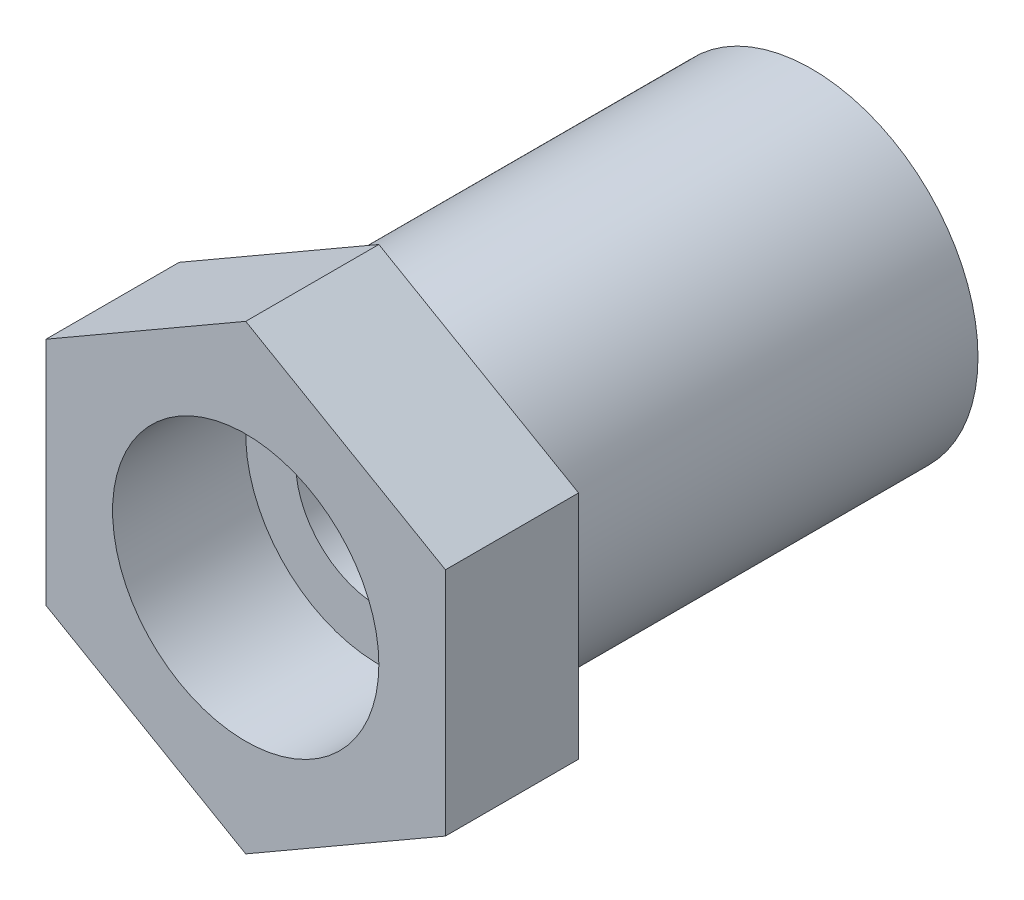
ISO-10303-21;
HEADER;
FILE_DESCRIPTION(('STEP AP214'),'2;1');
FILE_NAME('part.step','',(''),(''),'','','');
FILE_SCHEMA(('AUTOMOTIVE_DESIGN { 1 0 10303 214 1 1 1 1 }'));
ENDSEC;
DATA;
#1=APPLICATION_CONTEXT('core data for automotive mechanical design processes');
#2=APPLICATION_PROTOCOL_DEFINITION('international standard','automotive_design',2000,#1);
#3=PRODUCT_CONTEXT('',#1,'mechanical');
#4=PRODUCT('Part','Part','',(#3));
#5=PRODUCT_RELATED_PRODUCT_CATEGORY('part','',(#4));
#6=PRODUCT_DEFINITION_FORMATION('','',#4);
#7=PRODUCT_DEFINITION_CONTEXT('part definition',#1,'design');
#8=PRODUCT_DEFINITION('design','',#6,#7);
#9=PRODUCT_DEFINITION_SHAPE('','',#8);
#10=(LENGTH_UNIT() NAMED_UNIT(*) SI_UNIT(.MILLI.,.METRE.));
#11=(NAMED_UNIT(*) PLANE_ANGLE_UNIT() SI_UNIT($,.RADIAN.));
#12=(NAMED_UNIT(*) SI_UNIT($,.STERADIAN.) SOLID_ANGLE_UNIT());
#13=UNCERTAINTY_MEASURE_WITH_UNIT(LENGTH_MEASURE(1.E-05),#10,'distance_accuracy_value','');
#14=(GEOMETRIC_REPRESENTATION_CONTEXT(3) GLOBAL_UNCERTAINTY_ASSIGNED_CONTEXT((#13)) GLOBAL_UNIT_ASSIGNED_CONTEXT((#10,
#11,#12)) REPRESENTATION_CONTEXT('',''));
#15=CARTESIAN_POINT('',(0.,0.,0.));
#16=DIRECTION('',(0.,0.,1.));
#17=DIRECTION('',(1.,0.,0.));
#18=AXIS2_PLACEMENT_3D('',#15,#16,#17);
#19=CARTESIAN_POINT('',(-29.0609497882638,5.3372408293461,13.));
#20=DIRECTION('',(0.,0.,-1.));
#21=DIRECTION('',(-1.,0.,0.));
#22=AXIS2_PLACEMENT_3D('',#19,#20,#21);
#23=CYLINDRICAL_SURFACE('',#22,5.);
#24=CARTESIAN_POINT('',(-29.0609497882638,5.3372408293461,13.));
#25=DIRECTION('',(0.,0.,1.));
#26=DIRECTION('',(1.,0.,0.));
#27=AXIS2_PLACEMENT_3D('',#24,#25,#26);
#28=CIRCLE('',#27,5.);
#29=CARTESIAN_POINT('',(-24.0609497882638,5.3372408293461,13.));
#30=VERTEX_POINT('',#29);
#31=EDGE_CURVE('E11',#30,#30,#28,.T.);
#32=ORIENTED_EDGE('',*,*,#31,.F.);
#33=EDGE_LOOP('',(#32));
#34=FACE_BOUND('',#33,.T.);
#35=CARTESIAN_POINT('',(-29.0609497882638,5.3372408293461,0.));
#36=DIRECTION('',(0.,0.,1.));
#37=DIRECTION('',(1.,0.,0.));
#38=AXIS2_PLACEMENT_3D('',#35,#36,#37);
#39=CIRCLE('',#38,5.);
#40=CARTESIAN_POINT('',(-24.0609497882638,5.3372408293461,0.));
#41=VERTEX_POINT('',#40);
#42=EDGE_CURVE('E36',#41,#41,#39,.T.);
#43=ORIENTED_EDGE('',*,*,#42,.T.);
#44=EDGE_LOOP('',(#43));
#45=FACE_BOUND('',#44,.T.);
#46=ADVANCED_FACE('F33',(#34,#45),#23,.T.);
#47=CARTESIAN_POINT('',(-29.0609497882638,5.3372408293461,0.));
#48=DIRECTION('',(0.,0.,1.));
#49=DIRECTION('',(1.,0.,0.));
#50=AXIS2_PLACEMENT_3D('',#47,#48,#49);
#51=PLANE('',#50);
#52=CARTESIAN_POINT('',(-29.0609497882638,5.3372408293461,0.));
#53=DIRECTION('',(0.,0.,-1.));
#54=DIRECTION('',(-1.,0.,0.));
#55=AXIS2_PLACEMENT_3D('',#52,#53,#54);
#56=CIRCLE('',#55,2.5);
#57=CARTESIAN_POINT('',(-31.5609497882638,5.3372408293461,0.));
#58=VERTEX_POINT('',#57);
#59=EDGE_CURVE('E122',#58,#58,#56,.T.);
#60=ORIENTED_EDGE('',*,*,#59,.F.);
#61=EDGE_LOOP('',(#60));
#62=FACE_BOUND('',#61,.T.);
#63=ORIENTED_EDGE('',*,*,#42,.F.);
#64=EDGE_LOOP('',(#63));
#65=FACE_BOUND('',#64,.T.);
#66=ADVANCED_FACE('F142',(#62,#65),#51,.F.);
#67=CARTESIAN_POINT('',(-23.0609497882638,1.87313921420835,17.));
#68=DIRECTION('',(-1.,0.,0.));
#69=DIRECTION('',(0.,0.,1.));
#70=AXIS2_PLACEMENT_3D('',#67,#68,#69);
#71=PLANE('',#70);
#72=DIRECTION('',(0.,1.,0.));
#73=VECTOR('',#72,1.);
#74=CARTESIAN_POINT('',(-23.0609497882638,1.87313921420835,13.));
#75=LINE('',#74,#73);
#76=CARTESIAN_POINT('',(-23.0609497882638,1.87313921420835,13.));
#77=VERTEX_POINT('',#76);
#78=CARTESIAN_POINT('',(-23.0609497882638,8.80134244448385,13.));
#79=VERTEX_POINT('',#78);
#80=EDGE_CURVE('E118',#77,#79,#75,.T.);
#81=ORIENTED_EDGE('',*,*,#80,.T.);
#82=DIRECTION('',(0.,0.,-1.));
#83=VECTOR('',#82,1.);
#84=CARTESIAN_POINT('',(-23.0609497882638,8.80134244448385,17.));
#85=LINE('',#84,#83);
#86=CARTESIAN_POINT('',(-23.0609497882638,8.80134244448385,17.));
#87=VERTEX_POINT('',#86);
#88=EDGE_CURVE('E136',#87,#79,#85,.T.);
#89=ORIENTED_EDGE('',*,*,#88,.F.);
#90=DIRECTION('',(0.,1.,0.));
#91=VECTOR('',#90,1.);
#92=CARTESIAN_POINT('',(-23.0609497882638,1.87313921420835,17.));
#93=LINE('',#92,#91);
#94=CARTESIAN_POINT('',(-23.0609497882638,1.87313921420835,17.));
#95=VERTEX_POINT('',#94);
#96=EDGE_CURVE('E129',#95,#87,#93,.T.);
#97=ORIENTED_EDGE('',*,*,#96,.F.);
#98=DIRECTION('',(0.,0.,-1.));
#99=VECTOR('',#98,1.);
#100=CARTESIAN_POINT('',(-23.0609497882638,1.87313921420835,17.));
#101=LINE('',#100,#99);
#102=EDGE_CURVE('E114',#95,#77,#101,.T.);
#103=ORIENTED_EDGE('',*,*,#102,.T.);
#104=EDGE_LOOP('',(#81,#89,#97,#103));
#105=FACE_BOUND('',#104,.T.);
#106=ADVANCED_FACE('F144',(#105),#71,.F.);
#107=CARTESIAN_POINT('',(-23.0609497882638,8.80134244448385,17.));
#108=DIRECTION('',(-0.5,-0.866025403784439,0.));
#109=DIRECTION('',(0.866025403784439,-0.5,0.));
#110=AXIS2_PLACEMENT_3D('',#107,#108,#109);
#111=PLANE('',#110);
#112=DIRECTION('',(-0.866025403784439,0.5,0.));
#113=VECTOR('',#112,1.);
#114=CARTESIAN_POINT('',(-23.0609497882638,8.80134244448385,13.));
#115=LINE('',#114,#113);
#116=CARTESIAN_POINT('',(-29.0609497882638,12.2654440596216,13.));
#117=VERTEX_POINT('',#116);
#118=EDGE_CURVE('E121',#79,#117,#115,.T.);
#119=ORIENTED_EDGE('',*,*,#118,.T.);
#120=DIRECTION('',(0.,0.,-1.));
#121=VECTOR('',#120,1.);
#122=CARTESIAN_POINT('',(-29.0609497882638,12.2654440596216,17.));
#123=LINE('',#122,#121);
#124=CARTESIAN_POINT('',(-29.0609497882638,12.2654440596216,17.));
#125=VERTEX_POINT('',#124);
#126=EDGE_CURVE('E133',#125,#117,#123,.T.);
#127=ORIENTED_EDGE('',*,*,#126,.F.);
#128=DIRECTION('',(-0.866025403784439,0.5,0.));
#129=VECTOR('',#128,1.);
#130=CARTESIAN_POINT('',(-23.0609497882638,8.80134244448385,17.));
#131=LINE('',#130,#129);
#132=EDGE_CURVE('E87',#87,#125,#131,.T.);
#133=ORIENTED_EDGE('',*,*,#132,.F.);
#134=ORIENTED_EDGE('',*,*,#88,.T.);
#135=EDGE_LOOP('',(#119,#127,#133,#134));
#136=FACE_BOUND('',#135,.T.);
#137=ADVANCED_FACE('F150',(#136),#111,.F.);
#138=CARTESIAN_POINT('',(-29.0609497882638,12.2654440596216,17.));
#139=DIRECTION('',(0.5,-0.866025403784439,0.));
#140=DIRECTION('',(0.866025403784439,0.5,0.));
#141=AXIS2_PLACEMENT_3D('',#138,#139,#140);
#142=PLANE('',#141);
#143=DIRECTION('',(-0.866025403784439,-0.5,0.));
#144=VECTOR('',#143,1.);
#145=CARTESIAN_POINT('',(-29.0609497882638,12.2654440596216,13.));
#146=LINE('',#145,#144);
#147=CARTESIAN_POINT('',(-35.0609497882638,8.80134244448385,13.));
#148=VERTEX_POINT('',#147);
#149=EDGE_CURVE('E124',#117,#148,#146,.T.);
#150=ORIENTED_EDGE('',*,*,#149,.T.);
#151=DIRECTION('',(0.,0.,-1.));
#152=VECTOR('',#151,1.);
#153=CARTESIAN_POINT('',(-35.0609497882638,8.80134244448385,17.));
#154=LINE('',#153,#152);
#155=CARTESIAN_POINT('',(-35.0609497882638,8.80134244448385,17.));
#156=VERTEX_POINT('',#155);
#157=EDGE_CURVE('E109',#156,#148,#154,.T.);
#158=ORIENTED_EDGE('',*,*,#157,.F.);
#159=DIRECTION('',(-0.866025403784439,-0.5,0.));
#160=VECTOR('',#159,1.);
#161=CARTESIAN_POINT('',(-29.0609497882638,12.2654440596216,17.));
#162=LINE('',#161,#160);
#163=EDGE_CURVE('E100',#125,#156,#162,.T.);
#164=ORIENTED_EDGE('',*,*,#163,.F.);
#165=ORIENTED_EDGE('',*,*,#126,.T.);
#166=EDGE_LOOP('',(#150,#158,#164,#165));
#167=FACE_BOUND('',#166,.T.);
#168=ADVANCED_FACE('F158',(#167),#142,.F.);
#169=CARTESIAN_POINT('',(-35.0609497882638,8.80134244448385,17.));
#170=DIRECTION('',(1.,0.,0.));
#171=DIRECTION('',(0.,1.,0.));
#172=AXIS2_PLACEMENT_3D('',#169,#170,#171);
#173=PLANE('',#172);
#174=DIRECTION('',(0.,-1.,0.));
#175=VECTOR('',#174,1.);
#176=CARTESIAN_POINT('',(-35.0609497882638,8.80134244448385,13.));
#177=LINE('',#176,#175);
#178=CARTESIAN_POINT('',(-35.0609497882638,1.87313921420835,13.));
#179=VERTEX_POINT('',#178);
#180=EDGE_CURVE('E108',#148,#179,#177,.T.);
#181=ORIENTED_EDGE('',*,*,#180,.T.);
#182=DIRECTION('',(0.,0.,-1.));
#183=VECTOR('',#182,1.);
#184=CARTESIAN_POINT('',(-35.0609497882638,1.87313921420835,17.));
#185=LINE('',#184,#183);
#186=CARTESIAN_POINT('',(-35.0609497882638,1.87313921420835,17.));
#187=VERTEX_POINT('',#186);
#188=EDGE_CURVE('E105',#187,#179,#185,.T.);
#189=ORIENTED_EDGE('',*,*,#188,.F.);
#190=DIRECTION('',(0.,-1.,0.));
#191=VECTOR('',#190,1.);
#192=CARTESIAN_POINT('',(-35.0609497882638,8.80134244448385,17.));
#193=LINE('',#192,#191);
#194=EDGE_CURVE('E94',#156,#187,#193,.T.);
#195=ORIENTED_EDGE('',*,*,#194,.F.);
#196=ORIENTED_EDGE('',*,*,#157,.T.);
#197=EDGE_LOOP('',(#181,#189,#195,#196));
#198=FACE_BOUND('',#197,.T.);
#199=ADVANCED_FACE('F106',(#198),#173,.F.);
#200=CARTESIAN_POINT('',(-35.0609497882638,1.87313921420835,17.));
#201=DIRECTION('',(0.5,0.866025403784438,0.));
#202=DIRECTION('',(-0.866025403784438,0.5,0.));
#203=AXIS2_PLACEMENT_3D('',#200,#201,#202);
#204=PLANE('',#203);
#205=DIRECTION('',(0.866025403784438,-0.5,0.));
#206=VECTOR('',#205,1.);
#207=CARTESIAN_POINT('',(-35.0609497882638,1.87313921420835,13.));
#208=LINE('',#207,#206);
#209=CARTESIAN_POINT('',(-29.0609497882638,-1.59096240092941,13.));
#210=VERTEX_POINT('',#209);
#211=EDGE_CURVE('E72',#179,#210,#208,.T.);
#212=ORIENTED_EDGE('',*,*,#211,.T.);
#213=DIRECTION('',(0.,0.,-1.));
#214=VECTOR('',#213,1.);
#215=CARTESIAN_POINT('',(-29.0609497882638,-1.59096240092941,17.));
#216=LINE('',#215,#214);
#217=CARTESIAN_POINT('',(-29.0609497882638,-1.59096240092941,17.));
#218=VERTEX_POINT('',#217);
#219=EDGE_CURVE('E110',#218,#210,#216,.T.);
#220=ORIENTED_EDGE('',*,*,#219,.F.);
#221=DIRECTION('',(0.866025403784438,-0.5,0.));
#222=VECTOR('',#221,1.);
#223=CARTESIAN_POINT('',(-35.0609497882638,1.87313921420835,17.));
#224=LINE('',#223,#222);
#225=EDGE_CURVE('E98',#187,#218,#224,.T.);
#226=ORIENTED_EDGE('',*,*,#225,.F.);
#227=ORIENTED_EDGE('',*,*,#188,.T.);
#228=EDGE_LOOP('',(#212,#220,#226,#227));
#229=FACE_BOUND('',#228,.T.);
#230=ADVANCED_FACE('F112',(#229),#204,.F.);
#231=CARTESIAN_POINT('',(-29.0609497882638,-1.59096240092941,17.));
#232=DIRECTION('',(-0.5,0.866025403784438,0.));
#233=DIRECTION('',(-0.866025403784439,-0.5,0.));
#234=AXIS2_PLACEMENT_3D('',#231,#232,#233);
#235=PLANE('',#234);
#236=DIRECTION('',(0.866025403784438,0.5,0.));
#237=VECTOR('',#236,1.);
#238=CARTESIAN_POINT('',(-29.0609497882638,-1.59096240092941,13.));
#239=LINE('',#238,#237);
#240=EDGE_CURVE('E78',#210,#77,#239,.T.);
#241=ORIENTED_EDGE('',*,*,#240,.T.);
#242=ORIENTED_EDGE('',*,*,#102,.F.);
#243=DIRECTION('',(0.866025403784438,0.5,0.));
#244=VECTOR('',#243,1.);
#245=CARTESIAN_POINT('',(-29.0609497882638,-1.59096240092941,17.));
#246=LINE('',#245,#244);
#247=EDGE_CURVE('E49',#218,#95,#246,.T.);
#248=ORIENTED_EDGE('',*,*,#247,.F.);
#249=ORIENTED_EDGE('',*,*,#219,.T.);
#250=EDGE_LOOP('',(#241,#242,#248,#249));
#251=FACE_BOUND('',#250,.T.);
#252=ADVANCED_FACE('F166',(#251),#235,.F.);
#253=CARTESIAN_POINT('',(0.,0.,17.));
#254=DIRECTION('',(0.,0.,1.));
#255=DIRECTION('',(1.,0.,0.));
#256=AXIS2_PLACEMENT_3D('',#253,#254,#255);
#257=PLANE('',#256);
#258=CARTESIAN_POINT('',(-29.0609497882638,5.3372408293461,17.));
#259=DIRECTION('',(0.,0.,1.));
#260=DIRECTION('',(1.,0.,0.));
#261=AXIS2_PLACEMENT_3D('',#258,#259,#260);
#262=CIRCLE('',#261,4.);
#263=CARTESIAN_POINT('',(-25.0609497882638,5.3372408293461,17.));
#264=VERTEX_POINT('',#263);
#265=EDGE_CURVE('E199',#264,#264,#262,.T.);
#266=ORIENTED_EDGE('',*,*,#265,.F.);
#267=EDGE_LOOP('',(#266));
#268=FACE_BOUND('',#267,.T.);
#269=ORIENTED_EDGE('',*,*,#96,.T.);
#270=ORIENTED_EDGE('',*,*,#132,.T.);
#271=ORIENTED_EDGE('',*,*,#163,.T.);
#272=ORIENTED_EDGE('',*,*,#194,.T.);
#273=ORIENTED_EDGE('',*,*,#225,.T.);
#274=ORIENTED_EDGE('',*,*,#247,.T.);
#275=EDGE_LOOP('',(#269,#270,#271,#272,#273,#274));
#276=FACE_BOUND('',#275,.T.);
#277=ADVANCED_FACE('F96',(#268,#276),#257,.T.);
#278=CARTESIAN_POINT('',(0.,0.,13.));
#279=DIRECTION('',(0.,0.,1.));
#280=DIRECTION('',(1.,0.,0.));
#281=AXIS2_PLACEMENT_3D('',#278,#279,#280);
#282=PLANE('',#281);
#283=ORIENTED_EDGE('',*,*,#31,.T.);
#284=EDGE_LOOP('',(#283));
#285=FACE_BOUND('',#284,.T.);
#286=ORIENTED_EDGE('',*,*,#80,.F.);
#287=ORIENTED_EDGE('',*,*,#240,.F.);
#288=ORIENTED_EDGE('',*,*,#211,.F.);
#289=ORIENTED_EDGE('',*,*,#180,.F.);
#290=ORIENTED_EDGE('',*,*,#149,.F.);
#291=ORIENTED_EDGE('',*,*,#118,.F.);
#292=EDGE_LOOP('',(#286,#287,#288,#289,#290,#291));
#293=FACE_BOUND('',#292,.T.);
#294=ADVANCED_FACE('F169',(#285,#293),#282,.F.);
#295=CARTESIAN_POINT('',(-29.0609497882638,5.3372408293461,13.));
#296=DIRECTION('',(0.,0.,-1.));
#297=DIRECTION('',(-1.,0.,0.));
#298=AXIS2_PLACEMENT_3D('',#295,#296,#297);
#299=CYLINDRICAL_SURFACE('',#298,2.5);
#300=CARTESIAN_POINT('',(-29.0609497882638,5.3372408293461,13.));
#301=DIRECTION('',(0.,0.,1.));
#302=DIRECTION('',(1.,0.,0.));
#303=AXIS2_PLACEMENT_3D('',#300,#301,#302);
#304=CIRCLE('',#303,2.5);
#305=CARTESIAN_POINT('',(-26.5609497882638,5.3372408293461,13.));
#306=VERTEX_POINT('',#305);
#307=EDGE_CURVE('E195',#306,#306,#304,.F.);
#308=ORIENTED_EDGE('',*,*,#307,.F.);
#309=EDGE_LOOP('',(#308));
#310=FACE_BOUND('',#309,.T.);
#311=ORIENTED_EDGE('',*,*,#59,.T.);
#312=EDGE_LOOP('',(#311));
#313=FACE_BOUND('',#312,.T.);
#314=ADVANCED_FACE('F172',(#310,#313),#299,.F.);
#315=CARTESIAN_POINT('',(-29.0609497882638,5.3372408293461,13.));
#316=DIRECTION('',(0.,0.,1.));
#317=DIRECTION('',(1.,0.,0.));
#318=AXIS2_PLACEMENT_3D('',#315,#316,#317);
#319=PLANE('',#318);
#320=CARTESIAN_POINT('',(-29.0609497882638,5.3372408293461,13.));
#321=DIRECTION('',(0.,0.,1.));
#322=DIRECTION('',(1.,0.,0.));
#323=AXIS2_PLACEMENT_3D('',#320,#321,#322);
#324=CIRCLE('',#323,4.);
#325=CARTESIAN_POINT('',(-25.0609497882638,5.3372408293461,13.));
#326=VERTEX_POINT('',#325);
#327=EDGE_CURVE('E192',#326,#326,#324,.T.);
#328=ORIENTED_EDGE('',*,*,#327,.T.);
#329=EDGE_LOOP('',(#328));
#330=FACE_BOUND('',#329,.T.);
#331=ORIENTED_EDGE('',*,*,#307,.T.);
#332=EDGE_LOOP('',(#331));
#333=FACE_BOUND('',#332,.T.);
#334=ADVANCED_FACE('F179',(#330,#333),#319,.T.);
#335=CARTESIAN_POINT('',(-29.0609497882638,5.3372408293461,13.));
#336=DIRECTION('',(0.,0.,1.));
#337=DIRECTION('',(1.,0.,0.));
#338=AXIS2_PLACEMENT_3D('',#335,#336,#337);
#339=CYLINDRICAL_SURFACE('',#338,4.);
#340=ORIENTED_EDGE('',*,*,#327,.F.);
#341=EDGE_LOOP('',(#340));
#342=FACE_BOUND('',#341,.T.);
#343=ORIENTED_EDGE('',*,*,#265,.T.);
#344=EDGE_LOOP('',(#343));
#345=FACE_BOUND('',#344,.T.);
#346=ADVANCED_FACE('F181',(#342,#345),#339,.F.);
#347=CLOSED_SHELL('',(#46,#66,#106,#137,#168,#199,#230,#252,#277,#294,#314,#334,#346));
#348=MANIFOLD_SOLID_BREP('B2',#347);
#349=ADVANCED_BREP_SHAPE_REPRESENTATION('',(#18,#348),#14);
#350=SHAPE_DEFINITION_REPRESENTATION(#9,#349);
ENDSEC;
END-ISO-10303-21;
